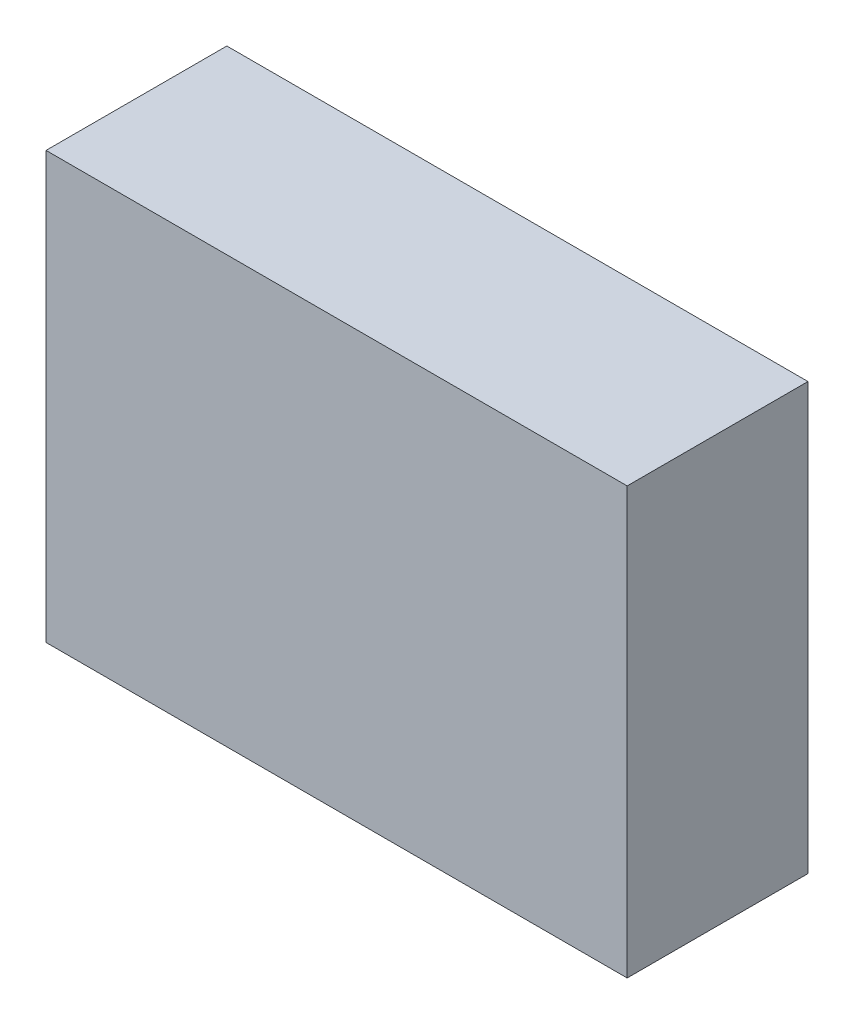
ISO-10303-21;
HEADER;
FILE_DESCRIPTION(('STEP AP214'),'2;1');
FILE_NAME('part.step','',(''),(''),'','','');
FILE_SCHEMA(('AUTOMOTIVE_DESIGN { 1 0 10303 214 1 1 1 1 }'));
ENDSEC;
DATA;
#1=APPLICATION_CONTEXT('core data for automotive mechanical design processes');
#2=APPLICATION_PROTOCOL_DEFINITION('international standard','automotive_design',2000,#1);
#3=PRODUCT_CONTEXT('',#1,'mechanical');
#4=PRODUCT('Part','Part','',(#3));
#5=PRODUCT_RELATED_PRODUCT_CATEGORY('part','',(#4));
#6=PRODUCT_DEFINITION_FORMATION('','',#4);
#7=PRODUCT_DEFINITION_CONTEXT('part definition',#1,'design');
#8=PRODUCT_DEFINITION('design','',#6,#7);
#9=PRODUCT_DEFINITION_SHAPE('','',#8);
#10=(LENGTH_UNIT() NAMED_UNIT(*) SI_UNIT(.MILLI.,.METRE.));
#11=(NAMED_UNIT(*) PLANE_ANGLE_UNIT() SI_UNIT($,.RADIAN.));
#12=(NAMED_UNIT(*) SI_UNIT($,.STERADIAN.) SOLID_ANGLE_UNIT());
#13=UNCERTAINTY_MEASURE_WITH_UNIT(LENGTH_MEASURE(1.E-05),#10,'distance_accuracy_value','');
#14=(GEOMETRIC_REPRESENTATION_CONTEXT(3) GLOBAL_UNCERTAINTY_ASSIGNED_CONTEXT((#13)) GLOBAL_UNIT_ASSIGNED_CONTEXT((#10,
#11,#12)) REPRESENTATION_CONTEXT('',''));
#15=CARTESIAN_POINT('',(0.,0.,0.));
#16=DIRECTION('',(0.,0.,1.));
#17=DIRECTION('',(1.,0.,0.));
#18=AXIS2_PLACEMENT_3D('',#15,#16,#17);
#19=CARTESIAN_POINT('',(-1.12499259396158,-0.825002094165313,-2.84112203121185));
#20=DIRECTION('',(-4.37113882867379E-08,-1.,0.));
#21=DIRECTION('',(1.,-4.37113882867379E-08,0.));
#22=AXIS2_PLACEMENT_3D('',#19,#20,#21);
#23=PLANE('',#22);
#24=DIRECTION('',(0.999999999999999,-4.37113882867379E-08,0.));
#25=VECTOR('',#24,1.);
#26=CARTESIAN_POINT('',(-1.12499259396158,-0.825002094165313,-2.84112203121185));
#27=LINE('',#26,#25);
#28=CARTESIAN_POINT('',(-1.12499259396158,-0.825002094165313,-2.84112203121185));
#29=VERTEX_POINT('',#28);
#30=CARTESIAN_POINT('',(1.12500740603842,-0.825002192515939,-2.84112203121185));
#31=VERTEX_POINT('',#30);
#32=EDGE_CURVE('E11',#29,#31,#27,.T.);
#33=ORIENTED_EDGE('',*,*,#32,.T.);
#34=DIRECTION('',(0.,0.,1.));
#35=VECTOR('',#34,1.);
#36=CARTESIAN_POINT('',(1.12500740603842,-0.825002192515937,-2.84112203121185));
#37=LINE('',#36,#35);
#38=CARTESIAN_POINT('',(1.12500740603842,-0.825002192515939,-2.14112091064453));
#39=VERTEX_POINT('',#38);
#40=EDGE_CURVE('E88',#31,#39,#37,.T.);
#41=ORIENTED_EDGE('',*,*,#40,.T.);
#42=DIRECTION('',(0.999999999999999,-4.37113882867379E-08,0.));
#43=VECTOR('',#42,1.);
#44=CARTESIAN_POINT('',(-1.12499259396158,-0.825002094165313,-2.14112091064453));
#45=LINE('',#44,#43);
#46=CARTESIAN_POINT('',(-1.12499259396158,-0.825002094165313,-2.14112091064453));
#47=VERTEX_POINT('',#46);
#48=EDGE_CURVE('E83',#47,#39,#45,.T.);
#49=ORIENTED_EDGE('',*,*,#48,.F.);
#50=DIRECTION('',(0.,0.,1.));
#51=VECTOR('',#50,1.);
#52=CARTESIAN_POINT('',(-1.12499259396158,-0.825002094165313,-2.84112203121185));
#53=LINE('',#52,#51);
#54=EDGE_CURVE('E72',#29,#47,#53,.T.);
#55=ORIENTED_EDGE('',*,*,#54,.F.);
#56=EDGE_LOOP('',(#33,#41,#49,#55));
#57=FACE_BOUND('',#56,.T.);
#58=ADVANCED_FACE('F17',(#57),#23,.T.);
#59=CARTESIAN_POINT('',(1.12500740603842,-0.825002192515939,-2.84112203121185));
#60=DIRECTION('',(1.,-4.37113882867379E-08,0.));
#61=DIRECTION('',(4.37113882867379E-08,1.,0.));
#62=AXIS2_PLACEMENT_3D('',#59,#60,#61);
#63=PLANE('',#62);
#64=DIRECTION('',(4.37113882740561E-08,0.999999999999999,0.));
#65=VECTOR('',#64,1.);
#66=CARTESIAN_POINT('',(1.12500740603842,-0.825002192515939,-2.84112203121185));
#67=LINE('',#66,#65);
#68=CARTESIAN_POINT('',(1.12500747816262,0.825006962757499,-2.84112203121185));
#69=VERTEX_POINT('',#68);
#70=EDGE_CURVE('E24',#31,#69,#67,.T.);
#71=ORIENTED_EDGE('',*,*,#70,.T.);
#72=DIRECTION('',(0.,0.,1.));
#73=VECTOR('',#72,1.);
#74=CARTESIAN_POINT('',(1.12500747816261,0.825006962757498,-2.84112203121185));
#75=LINE('',#74,#73);
#76=CARTESIAN_POINT('',(1.12500747816262,0.825006962757499,-2.14112091064453));
#77=VERTEX_POINT('',#76);
#78=EDGE_CURVE('E85',#69,#77,#75,.T.);
#79=ORIENTED_EDGE('',*,*,#78,.T.);
#80=DIRECTION('',(4.37113882740561E-08,0.999999999999999,0.));
#81=VECTOR('',#80,1.);
#82=CARTESIAN_POINT('',(1.12500740603842,-0.825002192515939,-2.14112091064453));
#83=LINE('',#82,#81);
#84=EDGE_CURVE('E66',#39,#77,#83,.T.);
#85=ORIENTED_EDGE('',*,*,#84,.F.);
#86=ORIENTED_EDGE('',*,*,#40,.F.);
#87=EDGE_LOOP('',(#71,#79,#85,#86));
#88=FACE_BOUND('',#87,.T.);
#89=ADVANCED_FACE('F89',(#88),#63,.T.);
#90=CARTESIAN_POINT('',(1.12500747816262,0.825006962757499,-2.84112203121185));
#91=DIRECTION('',(4.37113882867379E-08,1.,0.));
#92=DIRECTION('',(-1.,4.37113882867379E-08,0.));
#93=AXIS2_PLACEMENT_3D('',#90,#91,#92);
#94=PLANE('',#93);
#95=DIRECTION('',(-0.999999999999999,4.37113882867379E-08,0.));
#96=VECTOR('',#95,1.);
#97=CARTESIAN_POINT('',(1.12500747816262,0.825006962757499,-2.84112203121185));
#98=LINE('',#97,#96);
#99=CARTESIAN_POINT('',(-1.12499252183738,0.825007061108124,-2.84112203121185));
#100=VERTEX_POINT('',#99);
#101=EDGE_CURVE('E62',#69,#100,#98,.T.);
#102=ORIENTED_EDGE('',*,*,#101,.T.);
#103=DIRECTION('',(0.,0.,1.));
#104=VECTOR('',#103,1.);
#105=CARTESIAN_POINT('',(-1.12499252183738,0.825007061108122,-2.84112203121185));
#106=LINE('',#105,#104);
#107=CARTESIAN_POINT('',(-1.12499252183738,0.825007061108124,-2.14112091064453));
#108=VERTEX_POINT('',#107);
#109=EDGE_CURVE('E55',#100,#108,#106,.T.);
#110=ORIENTED_EDGE('',*,*,#109,.T.);
#111=DIRECTION('',(-0.999999999999999,4.37113882867379E-08,0.));
#112=VECTOR('',#111,1.);
#113=CARTESIAN_POINT('',(1.12500747816262,0.825006962757499,-2.14112091064453));
#114=LINE('',#113,#112);
#115=EDGE_CURVE('E59',#77,#108,#114,.T.);
#116=ORIENTED_EDGE('',*,*,#115,.F.);
#117=ORIENTED_EDGE('',*,*,#78,.F.);
#118=EDGE_LOOP('',(#102,#110,#116,#117));
#119=FACE_BOUND('',#118,.T.);
#120=ADVANCED_FACE('F57',(#119),#94,.T.);
#121=CARTESIAN_POINT('',(-1.12499252183738,0.825007061108124,-2.84112203121185));
#122=DIRECTION('',(-1.,4.37113882867379E-08,0.));
#123=DIRECTION('',(-4.37113882867379E-08,-1.,0.));
#124=AXIS2_PLACEMENT_3D('',#121,#122,#123);
#125=PLANE('',#124);
#126=DIRECTION('',(-4.37113882740561E-08,-0.999999999999999,0.));
#127=VECTOR('',#126,1.);
#128=CARTESIAN_POINT('',(-1.12499252183738,0.825007061108124,-2.84112203121185));
#129=LINE('',#128,#127);
#130=EDGE_CURVE('E65',#100,#29,#129,.T.);
#131=ORIENTED_EDGE('',*,*,#130,.T.);
#132=ORIENTED_EDGE('',*,*,#54,.T.);
#133=DIRECTION('',(-4.37113882740561E-08,-0.999999999999999,0.));
#134=VECTOR('',#133,1.);
#135=CARTESIAN_POINT('',(-1.12499252183738,0.825007061108124,-2.14112091064453));
#136=LINE('',#135,#134);
#137=EDGE_CURVE('E70',#108,#47,#136,.T.);
#138=ORIENTED_EDGE('',*,*,#137,.F.);
#139=ORIENTED_EDGE('',*,*,#109,.F.);
#140=EDGE_LOOP('',(#131,#132,#138,#139));
#141=FACE_BOUND('',#140,.T.);
#142=ADVANCED_FACE('F71',(#141),#125,.T.);
#143=CARTESIAN_POINT('',(-118.849983215332,178.824996948242,-2.14112091064453));
#144=DIRECTION('',(0.,0.,1.));
#145=DIRECTION('',(-4.37113882867379E-08,-1.,0.));
#146=AXIS2_PLACEMENT_3D('',#143,#144,#145);
#147=PLANE('',#146);
#148=ORIENTED_EDGE('',*,*,#48,.T.);
#149=ORIENTED_EDGE('',*,*,#84,.T.);
#150=ORIENTED_EDGE('',*,*,#115,.T.);
#151=ORIENTED_EDGE('',*,*,#137,.T.);
#152=EDGE_LOOP('',(#148,#149,#150,#151));
#153=FACE_BOUND('',#152,.T.);
#154=ADVANCED_FACE('F76',(#153),#147,.T.);
#155=CARTESIAN_POINT('',(-118.849983215332,178.824996948242,-2.84112203121185));
#156=DIRECTION('',(0.,0.,1.));
#157=DIRECTION('',(-4.37113882867379E-08,-1.,0.));
#158=AXIS2_PLACEMENT_3D('',#155,#156,#157);
#159=PLANE('',#158);
#160=ORIENTED_EDGE('',*,*,#130,.F.);
#161=ORIENTED_EDGE('',*,*,#101,.F.);
#162=ORIENTED_EDGE('',*,*,#70,.F.);
#163=ORIENTED_EDGE('',*,*,#32,.F.);
#164=EDGE_LOOP('',(#160,#161,#162,#163));
#165=FACE_BOUND('',#164,.T.);
#166=ADVANCED_FACE('F91',(#165),#159,.F.);
#167=CLOSED_SHELL('',(#58,#89,#120,#142,#154,#166));
#168=MANIFOLD_SOLID_BREP('B1',#167);
#169=ADVANCED_BREP_SHAPE_REPRESENTATION('',(#18,#168),#14);
#170=SHAPE_DEFINITION_REPRESENTATION(#9,#169);
ENDSEC;
END-ISO-10303-21;
